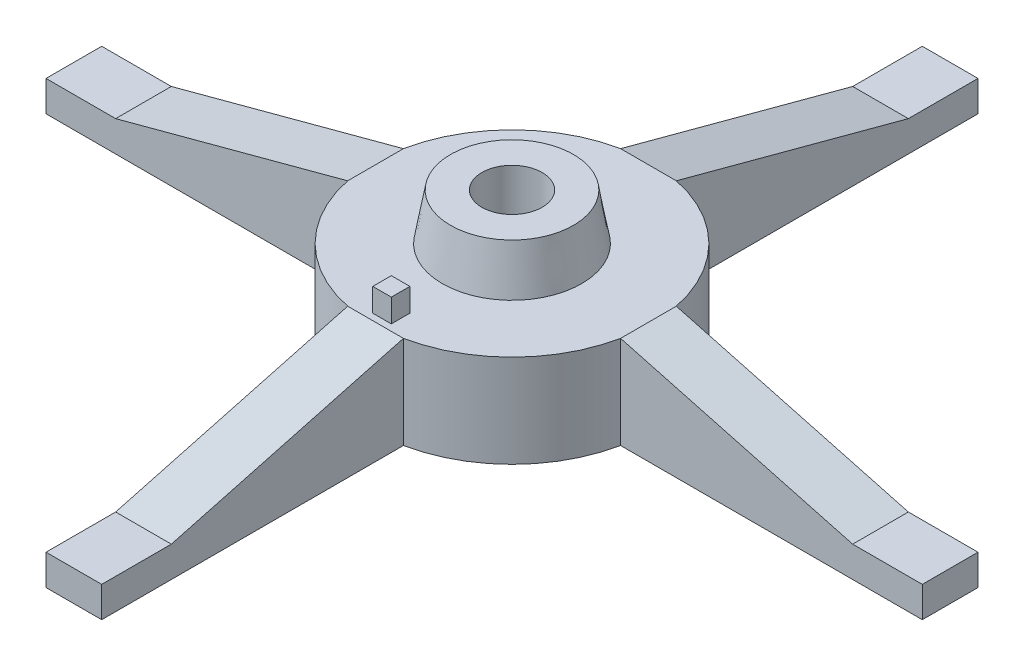
ISO-10303-21;
HEADER;
FILE_DESCRIPTION(('STEP AP214'),'2;1');
FILE_NAME('part.step','',(''),(''),'','','');
FILE_SCHEMA(('AUTOMOTIVE_DESIGN { 1 0 10303 214 1 1 1 1 }'));
ENDSEC;
DATA;
#1=APPLICATION_CONTEXT('core data for automotive mechanical design processes');
#2=APPLICATION_PROTOCOL_DEFINITION('international standard','automotive_design',2000,#1);
#3=PRODUCT_CONTEXT('',#1,'mechanical');
#4=PRODUCT('Part','Part','',(#3));
#5=PRODUCT_RELATED_PRODUCT_CATEGORY('part','',(#4));
#6=PRODUCT_DEFINITION_FORMATION('','',#4);
#7=PRODUCT_DEFINITION_CONTEXT('part definition',#1,'design');
#8=PRODUCT_DEFINITION('design','',#6,#7);
#9=PRODUCT_DEFINITION_SHAPE('','',#8);
#10=(LENGTH_UNIT() NAMED_UNIT(*) SI_UNIT(.MILLI.,.METRE.));
#11=(NAMED_UNIT(*) PLANE_ANGLE_UNIT() SI_UNIT($,.RADIAN.));
#12=(NAMED_UNIT(*) SI_UNIT($,.STERADIAN.) SOLID_ANGLE_UNIT());
#13=UNCERTAINTY_MEASURE_WITH_UNIT(LENGTH_MEASURE(1.E-05),#10,'distance_accuracy_value','');
#14=(GEOMETRIC_REPRESENTATION_CONTEXT(3) GLOBAL_UNCERTAINTY_ASSIGNED_CONTEXT((#13)) GLOBAL_UNIT_ASSIGNED_CONTEXT((#10,
#11,#12)) REPRESENTATION_CONTEXT('',''));
#15=CARTESIAN_POINT('',(0.,0.,0.));
#16=DIRECTION('',(0.,0.,1.));
#17=DIRECTION('',(1.,0.,0.));
#18=AXIS2_PLACEMENT_3D('',#15,#16,#17);
#19=CARTESIAN_POINT('',(0.,20.,0.));
#20=DIRECTION('',(0.,1.,0.));
#21=DIRECTION('',(0.,0.,1.));
#22=AXIS2_PLACEMENT_3D('',#19,#20,#21);
#23=PLANE('',#22);
#24=CARTESIAN_POINT('',(0.,20.,0.));
#25=DIRECTION('',(0.,1.,0.));
#26=DIRECTION('',(0.,0.,1.));
#27=AXIS2_PLACEMENT_3D('',#24,#25,#26);
#28=CIRCLE('',#27,15.);
#29=CARTESIAN_POINT('',(0.,20.,15.));
#30=VERTEX_POINT('',#29);
#31=EDGE_CURVE('E221',#30,#30,#28,.T.);
#32=ORIENTED_EDGE('',*,*,#31,.F.);
#33=EDGE_LOOP('',(#32));
#34=FACE_BOUND('',#33,.T.);
#35=DIRECTION('',(0.,0.,1.));
#36=VECTOR('',#35,1.);
#37=CARTESIAN_POINT('',(29.3938769133991,20.,-94.3938769133988));
#38=LINE('',#37,#36);
#39=CARTESIAN_POINT('',(29.3938769133982,20.,-5.99999999999935));
#40=VERTEX_POINT('',#39);
#41=CARTESIAN_POINT('',(29.3938769133981,20.,6.00000000000031));
#42=VERTEX_POINT('',#41);
#43=EDGE_CURVE('E234',#40,#42,#38,.T.);
#44=ORIENTED_EDGE('',*,*,#43,.F.);
#45=CARTESIAN_POINT('',(0.,20.,0.));
#46=DIRECTION('',(0.,1.,0.));
#47=DIRECTION('',(0.,0.,1.));
#48=AXIS2_PLACEMENT_3D('',#45,#46,#47);
#49=CIRCLE('',#48,30.);
#50=CARTESIAN_POINT('',(6.,20.,-29.3938769133981));
#51=VERTEX_POINT('',#50);
#52=EDGE_CURVE('E358',#40,#51,#49,.T.);
#53=ORIENTED_EDGE('',*,*,#52,.T.);
#54=DIRECTION('',(1.,0.,0.));
#55=VECTOR('',#54,1.);
#56=CARTESIAN_POINT('',(-94.3938769133982,20.,-29.3938769133981));
#57=LINE('',#56,#55);
#58=CARTESIAN_POINT('',(-6.00000000000001,20.,-29.3938769133981));
#59=VERTEX_POINT('',#58);
#60=EDGE_CURVE('E246',#59,#51,#57,.T.);
#61=ORIENTED_EDGE('',*,*,#60,.F.);
#62=CARTESIAN_POINT('',(-29.3938769133981,20.,-6.00000000000011));
#63=VERTEX_POINT('',#62);
#64=EDGE_CURVE('E771',#59,#63,#49,.T.);
#65=ORIENTED_EDGE('',*,*,#64,.T.);
#66=DIRECTION('',(0.,0.,-1.));
#67=VECTOR('',#66,1.);
#68=CARTESIAN_POINT('',(-29.3938769133985,20.,94.3938769133984));
#69=LINE('',#68,#67);
#70=CARTESIAN_POINT('',(-29.3938769133982,20.,5.99999999999978));
#71=VERTEX_POINT('',#70);
#72=EDGE_CURVE('E258',#71,#63,#69,.T.);
#73=ORIENTED_EDGE('',*,*,#72,.F.);
#74=CARTESIAN_POINT('',(-6.,20.,29.3938769133981));
#75=VERTEX_POINT('',#74);
#76=EDGE_CURVE('E359',#71,#75,#49,.T.);
#77=ORIENTED_EDGE('',*,*,#76,.T.);
#78=DIRECTION('',(-1.,0.,0.));
#79=VECTOR('',#78,1.);
#80=CARTESIAN_POINT('',(30.,20.,29.3938769133981));
#81=LINE('',#80,#79);
#82=CARTESIAN_POINT('',(6.00000000000001,20.,29.3938769133981));
#83=VERTEX_POINT('',#82);
#84=EDGE_CURVE('E327',#83,#75,#81,.T.);
#85=ORIENTED_EDGE('',*,*,#84,.F.);
#86=EDGE_CURVE('E354',#83,#42,#49,.T.);
#87=ORIENTED_EDGE('',*,*,#86,.T.);
#88=EDGE_LOOP('',(#44,#53,#61,#65,#73,#77,#85,#87));
#89=FACE_BOUND('',#88,.T.);
#90=DIRECTION('',(0.,0.,1.));
#91=VECTOR('',#90,1.);
#92=CARTESIAN_POINT('',(2.,20.,0.));
#93=LINE('',#92,#91);
#94=CARTESIAN_POINT('',(2.,20.,24.));
#95=VERTEX_POINT('',#94);
#96=CARTESIAN_POINT('',(2.,20.,28.));
#97=VERTEX_POINT('',#96);
#98=EDGE_CURVE('E40',#95,#97,#93,.T.);
#99=ORIENTED_EDGE('',*,*,#98,.T.);
#100=DIRECTION('',(-1.,0.,0.));
#101=VECTOR('',#100,1.);
#102=CARTESIAN_POINT('',(0.,20.,28.));
#103=LINE('',#102,#101);
#104=CARTESIAN_POINT('',(-2.,20.,28.));
#105=VERTEX_POINT('',#104);
#106=EDGE_CURVE('E11',#97,#105,#103,.T.);
#107=ORIENTED_EDGE('',*,*,#106,.T.);
#108=DIRECTION('',(0.,0.,1.));
#109=VECTOR('',#108,1.);
#110=CARTESIAN_POINT('',(-2.,20.,0.));
#111=LINE('',#110,#109);
#112=CARTESIAN_POINT('',(-2.,20.,24.));
#113=VERTEX_POINT('',#112);
#114=EDGE_CURVE('E386',#113,#105,#111,.T.);
#115=ORIENTED_EDGE('',*,*,#114,.F.);
#116=DIRECTION('',(-1.,0.,0.));
#117=VECTOR('',#116,1.);
#118=CARTESIAN_POINT('',(0.,20.,24.));
#119=LINE('',#118,#117);
#120=EDGE_CURVE('E50',#95,#113,#119,.T.);
#121=ORIENTED_EDGE('',*,*,#120,.F.);
#122=EDGE_LOOP('',(#99,#107,#115,#121));
#123=FACE_BOUND('',#122,.T.);
#124=ADVANCED_FACE('F32',(#34,#89,#123),#23,.T.);
#125=CARTESIAN_POINT('',(0.,0.,0.));
#126=DIRECTION('',(0.,1.,0.));
#127=DIRECTION('',(0.,0.,1.));
#128=AXIS2_PLACEMENT_3D('',#125,#126,#127);
#129=PLANE('',#128);
#130=CARTESIAN_POINT('',(0.,0.,0.));
#131=DIRECTION('',(0.,1.,0.));
#132=DIRECTION('',(0.,0.,1.));
#133=AXIS2_PLACEMENT_3D('',#130,#131,#132);
#134=CIRCLE('',#133,6.5);
#135=CARTESIAN_POINT('',(0.,0.,6.5));
#136=VERTEX_POINT('',#135);
#137=EDGE_CURVE('E211',#136,#136,#134,.T.);
#138=ORIENTED_EDGE('',*,*,#137,.T.);
#139=EDGE_LOOP('',(#138));
#140=FACE_BOUND('',#139,.T.);
#141=CARTESIAN_POINT('',(0.,0.,0.));
#142=DIRECTION('',(0.,1.,0.));
#143=DIRECTION('',(0.,0.,1.));
#144=AXIS2_PLACEMENT_3D('',#141,#142,#143);
#145=CIRCLE('',#144,30.);
#146=CARTESIAN_POINT('',(6.,0.,29.3938769133981));
#147=VERTEX_POINT('',#146);
#148=CARTESIAN_POINT('',(29.3938769133981,0.,6.00000000000031));
#149=VERTEX_POINT('',#148);
#150=EDGE_CURVE('E360',#147,#149,#145,.T.);
#151=ORIENTED_EDGE('',*,*,#150,.F.);
#152=DIRECTION('',(0.,0.,-1.));
#153=VECTOR('',#152,1.);
#154=CARTESIAN_POINT('',(6.,0.,0.));
#155=LINE('',#154,#153);
#156=CARTESIAN_POINT('',(6.,0.,94.3938769133981));
#157=VERTEX_POINT('',#156);
#158=EDGE_CURVE('E335',#157,#147,#155,.T.);
#159=ORIENTED_EDGE('',*,*,#158,.F.);
#160=DIRECTION('',(1.,0.,0.));
#161=VECTOR('',#160,1.);
#162=CARTESIAN_POINT('',(0.,0.,94.3938769133981));
#163=LINE('',#162,#161);
#164=CARTESIAN_POINT('',(-6.,0.,94.3938769133981));
#165=VERTEX_POINT('',#164);
#166=EDGE_CURVE('E340',#165,#157,#163,.T.);
#167=ORIENTED_EDGE('',*,*,#166,.F.);
#168=DIRECTION('',(0.,0.,1.));
#169=VECTOR('',#168,1.);
#170=CARTESIAN_POINT('',(-6.00000000000001,0.,0.));
#171=LINE('',#170,#169);
#172=CARTESIAN_POINT('',(-6.,0.,29.3938769133981));
#173=VERTEX_POINT('',#172);
#174=EDGE_CURVE('E344',#173,#165,#171,.T.);
#175=ORIENTED_EDGE('',*,*,#174,.F.);
#176=CARTESIAN_POINT('',(-29.3938769133982,0.,5.9999999999999));
#177=VERTEX_POINT('',#176);
#178=EDGE_CURVE('E338',#177,#173,#145,.T.);
#179=ORIENTED_EDGE('',*,*,#178,.F.);
#180=DIRECTION('',(1.,0.,0.));
#181=VECTOR('',#180,1.);
#182=CARTESIAN_POINT('',(0.,0.,6.));
#183=LINE('',#182,#181);
#184=CARTESIAN_POINT('',(-94.3938769133982,0.,5.99999999999967));
#185=VERTEX_POINT('',#184);
#186=EDGE_CURVE('E303',#185,#177,#183,.T.);
#187=ORIENTED_EDGE('',*,*,#186,.F.);
#188=DIRECTION('',(0.,0.,1.));
#189=VECTOR('',#188,1.);
#190=CARTESIAN_POINT('',(-94.3938769133981,0.,-3.29574459744185E-13));
#191=LINE('',#190,#189);
#192=CARTESIAN_POINT('',(-94.3938769133981,0.,-6.00000000000033));
#193=VERTEX_POINT('',#192);
#194=EDGE_CURVE('E308',#193,#185,#191,.T.);
#195=ORIENTED_EDGE('',*,*,#194,.F.);
#196=DIRECTION('',(-1.,0.,0.));
#197=VECTOR('',#196,1.);
#198=CARTESIAN_POINT('',(0.,0.,-6.00000000000001));
#199=LINE('',#198,#197);
#200=CARTESIAN_POINT('',(-29.3938769133981,0.,-6.00000000000011));
#201=VERTEX_POINT('',#200);
#202=EDGE_CURVE('E312',#201,#193,#199,.T.);
#203=ORIENTED_EDGE('',*,*,#202,.F.);
#204=CARTESIAN_POINT('',(-6.,0.,-29.3938769133981));
#205=VERTEX_POINT('',#204);
#206=EDGE_CURVE('E755',#205,#201,#145,.T.);
#207=ORIENTED_EDGE('',*,*,#206,.F.);
#208=DIRECTION('',(0.,0.,1.));
#209=VECTOR('',#208,1.);
#210=CARTESIAN_POINT('',(-6.,0.,0.));
#211=LINE('',#210,#209);
#212=CARTESIAN_POINT('',(-6.,0.,-94.3938769133981));
#213=VERTEX_POINT('',#212);
#214=EDGE_CURVE('E284',#213,#205,#211,.T.);
#215=ORIENTED_EDGE('',*,*,#214,.F.);
#216=DIRECTION('',(-1.,0.,0.));
#217=VECTOR('',#216,1.);
#218=CARTESIAN_POINT('',(0.,0.,-94.3938769133981));
#219=LINE('',#218,#217);
#220=CARTESIAN_POINT('',(6.,0.,-94.3938769133981));
#221=VERTEX_POINT('',#220);
#222=EDGE_CURVE('E289',#221,#213,#219,.T.);
#223=ORIENTED_EDGE('',*,*,#222,.F.);
#224=DIRECTION('',(0.,0.,-1.));
#225=VECTOR('',#224,1.);
#226=CARTESIAN_POINT('',(6.00000000000001,0.,0.));
#227=LINE('',#226,#225);
#228=CARTESIAN_POINT('',(6.,0.,-29.3938769133981));
#229=VERTEX_POINT('',#228);
#230=EDGE_CURVE('E293',#229,#221,#227,.T.);
#231=ORIENTED_EDGE('',*,*,#230,.F.);
#232=CARTESIAN_POINT('',(29.3938769133982,0.,-5.9999999999997));
#233=VERTEX_POINT('',#232);
#234=EDGE_CURVE('E362',#233,#229,#145,.T.);
#235=ORIENTED_EDGE('',*,*,#234,.F.);
#236=DIRECTION('',(-1.,0.,0.));
#237=VECTOR('',#236,1.);
#238=CARTESIAN_POINT('',(0.,0.,-6.));
#239=LINE('',#238,#237);
#240=CARTESIAN_POINT('',(94.3938769133982,0.,-5.99999999999902));
#241=VERTEX_POINT('',#240);
#242=EDGE_CURVE('E265',#241,#233,#239,.T.);
#243=ORIENTED_EDGE('',*,*,#242,.F.);
#244=DIRECTION('',(0.,0.,-1.));
#245=VECTOR('',#244,1.);
#246=CARTESIAN_POINT('',(94.3938769133981,0.,9.88723379232556E-13));
#247=LINE('',#246,#245);
#248=CARTESIAN_POINT('',(94.3938769133981,0.,6.00000000000098));
#249=VERTEX_POINT('',#248);
#250=EDGE_CURVE('E270',#249,#241,#247,.T.);
#251=ORIENTED_EDGE('',*,*,#250,.F.);
#252=DIRECTION('',(1.,0.,0.));
#253=VECTOR('',#252,1.);
#254=CARTESIAN_POINT('',(0.,0.,6.00000000000001));
#255=LINE('',#254,#253);
#256=EDGE_CURVE('E274',#149,#249,#255,.T.);
#257=ORIENTED_EDGE('',*,*,#256,.F.);
#258=EDGE_LOOP('',(#151,#159,#167,#175,#179,#187,#195,#203,#207,#215,#223,#231,#235,#243,#251,#257));
#259=FACE_BOUND('',#258,.T.);
#260=ADVANCED_FACE('F399',(#140,#259),#129,.F.);
#261=CARTESIAN_POINT('',(0.,30.,0.));
#262=DIRECTION('',(0.,1.,0.));
#263=DIRECTION('',(0.,0.,1.));
#264=AXIS2_PLACEMENT_3D('',#261,#262,#263);
#265=PLANE('',#264);
#266=CARTESIAN_POINT('',(0.,30.,0.));
#267=DIRECTION('',(0.,1.,0.));
#268=DIRECTION('',(0.,0.,1.));
#269=AXIS2_PLACEMENT_3D('',#266,#267,#268);
#270=CIRCLE('',#269,13.2367301929153);
#271=CARTESIAN_POINT('',(0.,30.,13.2367301929153));
#272=VERTEX_POINT('',#271);
#273=EDGE_CURVE('E225',#272,#272,#270,.T.);
#274=ORIENTED_EDGE('',*,*,#273,.T.);
#275=EDGE_LOOP('',(#274));
#276=FACE_BOUND('',#275,.T.);
#277=CARTESIAN_POINT('',(0.,30.,0.));
#278=DIRECTION('',(0.,1.,0.));
#279=DIRECTION('',(0.,0.,1.));
#280=AXIS2_PLACEMENT_3D('',#277,#278,#279);
#281=CIRCLE('',#280,6.5);
#282=CARTESIAN_POINT('',(0.,30.,6.5));
#283=VERTEX_POINT('',#282);
#284=EDGE_CURVE('E214',#283,#283,#281,.T.);
#285=ORIENTED_EDGE('',*,*,#284,.F.);
#286=EDGE_LOOP('',(#285));
#287=FACE_BOUND('',#286,.T.);
#288=ADVANCED_FACE('F405',(#276,#287),#265,.T.);
#289=CARTESIAN_POINT('',(0.,20.,0.));
#290=DIRECTION('',(0.,-1.,0.));
#291=DIRECTION('',(0.,0.,-1.));
#292=AXIS2_PLACEMENT_3D('',#289,#290,#291);
#293=CYLINDRICAL_SURFACE('',#292,30.);
#294=DIRECTION('',(0.,-1.,0.));
#295=VECTOR('',#294,1.);
#296=CARTESIAN_POINT('',(29.3938769133981,86.0984114786432,6.00000000000031));
#297=LINE('',#296,#295);
#298=EDGE_CURVE('E277',#42,#149,#297,.T.);
#299=ORIENTED_EDGE('',*,*,#298,.F.);
#300=ORIENTED_EDGE('',*,*,#86,.F.);
#301=DIRECTION('',(0.,-1.,0.));
#302=VECTOR('',#301,1.);
#303=CARTESIAN_POINT('',(6.,86.098411478643,29.3938769133981));
#304=LINE('',#303,#302);
#305=EDGE_CURVE('E330',#83,#147,#304,.T.);
#306=ORIENTED_EDGE('',*,*,#305,.T.);
#307=ORIENTED_EDGE('',*,*,#150,.T.);
#308=EDGE_LOOP('',(#299,#300,#306,#307));
#309=FACE_BOUND('',#308,.T.);
#310=ADVANCED_FACE('F34',(#309),#293,.T.);
#311=DIRECTION('',(0.,-1.,0.));
#312=VECTOR('',#311,1.);
#313=CARTESIAN_POINT('',(29.3938769133982,86.0984114786432,-5.9999999999997));
#314=LINE('',#313,#312);
#315=EDGE_CURVE('E260',#40,#233,#314,.T.);
#316=ORIENTED_EDGE('',*,*,#315,.T.);
#317=ORIENTED_EDGE('',*,*,#234,.T.);
#318=DIRECTION('',(0.,-1.,0.));
#319=VECTOR('',#318,1.);
#320=CARTESIAN_POINT('',(6.,86.098411478643,-29.3938769133981));
#321=LINE('',#320,#319);
#322=EDGE_CURVE('E296',#51,#229,#321,.T.);
#323=ORIENTED_EDGE('',*,*,#322,.F.);
#324=ORIENTED_EDGE('',*,*,#52,.F.);
#325=EDGE_LOOP('',(#316,#317,#323,#324));
#326=FACE_BOUND('',#325,.T.);
#327=ADVANCED_FACE('F633',(#326),#293,.T.);
#328=DIRECTION('',(0.,-1.,0.));
#329=VECTOR('',#328,1.);
#330=CARTESIAN_POINT('',(-6.,86.098411478643,-29.3938769133981));
#331=LINE('',#330,#329);
#332=EDGE_CURVE('E268',#59,#205,#331,.T.);
#333=ORIENTED_EDGE('',*,*,#332,.T.);
#334=ORIENTED_EDGE('',*,*,#206,.T.);
#335=DIRECTION('',(0.,-1.,0.));
#336=VECTOR('',#335,1.);
#337=CARTESIAN_POINT('',(-29.3938769133981,86.0984114786431,-6.00000000000011));
#338=LINE('',#337,#336);
#339=EDGE_CURVE('E315',#63,#201,#338,.T.);
#340=ORIENTED_EDGE('',*,*,#339,.F.);
#341=ORIENTED_EDGE('',*,*,#64,.F.);
#342=EDGE_LOOP('',(#333,#334,#340,#341));
#343=FACE_BOUND('',#342,.T.);
#344=ADVANCED_FACE('F626',(#343),#293,.T.);
#345=DIRECTION('',(0.,-1.,0.));
#346=VECTOR('',#345,1.);
#347=CARTESIAN_POINT('',(-29.3938769133982,86.0984114786431,5.9999999999999));
#348=LINE('',#347,#346);
#349=EDGE_CURVE('E287',#71,#177,#348,.T.);
#350=ORIENTED_EDGE('',*,*,#349,.T.);
#351=ORIENTED_EDGE('',*,*,#178,.T.);
#352=DIRECTION('',(0.,-1.,0.));
#353=VECTOR('',#352,1.);
#354=CARTESIAN_POINT('',(-6.,86.098411478643,29.3938769133981));
#355=LINE('',#354,#353);
#356=EDGE_CURVE('E347',#75,#173,#355,.T.);
#357=ORIENTED_EDGE('',*,*,#356,.F.);
#358=ORIENTED_EDGE('',*,*,#76,.F.);
#359=EDGE_LOOP('',(#350,#351,#357,#358));
#360=FACE_BOUND('',#359,.T.);
#361=ADVANCED_FACE('F414',(#360),#293,.T.);
#362=CARTESIAN_POINT('',(-6.00000000000001,86.098411478643,0.));
#363=DIRECTION('',(1.,0.,0.));
#364=DIRECTION('',(0.,0.,-1.));
#365=AXIS2_PLACEMENT_3D('',#362,#363,#364);
#366=PLANE('',#365);
#367=DIRECTION('',(0.,0.,1.));
#368=VECTOR('',#367,1.);
#369=CARTESIAN_POINT('',(-6.,6.60254037844422,94.3938769133981));
#370=LINE('',#369,#368);
#371=CARTESIAN_POINT('',(-6.,6.60254037844422,79.3938769133981));
#372=VERTEX_POINT('',#371);
#373=CARTESIAN_POINT('',(-6.,6.60254037844422,94.3938769133981));
#374=VERTEX_POINT('',#373);
#375=EDGE_CURVE('E324',#372,#374,#370,.T.);
#376=ORIENTED_EDGE('',*,*,#375,.F.);
#377=DIRECTION('',(0.,-0.258819045102514,0.96592582628907));
#378=VECTOR('',#377,1.);
#379=CARTESIAN_POINT('',(-6.,6.60254037844422,79.3938769133981));
#380=LINE('',#379,#378);
#381=EDGE_CURVE('E306',#75,#372,#380,.T.);
#382=ORIENTED_EDGE('',*,*,#381,.F.);
#383=ORIENTED_EDGE('',*,*,#356,.T.);
#384=ORIENTED_EDGE('',*,*,#174,.T.);
#385=DIRECTION('',(0.,-1.,0.));
#386=VECTOR('',#385,1.);
#387=CARTESIAN_POINT('',(-6.,86.098411478643,94.3938769133981));
#388=LINE('',#387,#386);
#389=EDGE_CURVE('E343',#374,#165,#388,.T.);
#390=ORIENTED_EDGE('',*,*,#389,.F.);
#391=EDGE_LOOP('',(#376,#382,#383,#384,#390));
#392=FACE_BOUND('',#391,.T.);
#393=ADVANCED_FACE('F410',(#392),#366,.F.);
#394=CARTESIAN_POINT('',(0.,86.098411478643,94.3938769133981));
#395=DIRECTION('',(0.,0.,-1.));
#396=DIRECTION('',(-1.,0.,0.));
#397=AXIS2_PLACEMENT_3D('',#394,#395,#396);
#398=PLANE('',#397);
#399=DIRECTION('',(0.,-1.,0.));
#400=VECTOR('',#399,1.);
#401=CARTESIAN_POINT('',(6.,86.098411478643,94.3938769133981));
#402=LINE('',#401,#400);
#403=CARTESIAN_POINT('',(6.,6.60254037844425,94.3938769133981));
#404=VERTEX_POINT('',#403);
#405=EDGE_CURVE('E339',#404,#157,#402,.T.);
#406=ORIENTED_EDGE('',*,*,#405,.F.);
#407=DIRECTION('',(-1.,0.,0.));
#408=VECTOR('',#407,1.);
#409=CARTESIAN_POINT('',(30.,6.60254037844422,94.3938769133981));
#410=LINE('',#409,#408);
#411=EDGE_CURVE('E331',#404,#374,#410,.T.);
#412=ORIENTED_EDGE('',*,*,#411,.T.);
#413=ORIENTED_EDGE('',*,*,#389,.T.);
#414=ORIENTED_EDGE('',*,*,#166,.T.);
#415=EDGE_LOOP('',(#406,#412,#413,#414));
#416=FACE_BOUND('',#415,.T.);
#417=ADVANCED_FACE('F413',(#416),#398,.F.);
#418=CARTESIAN_POINT('',(6.,86.098411478643,0.));
#419=DIRECTION('',(-1.,0.,0.));
#420=DIRECTION('',(0.,0.,1.));
#421=AXIS2_PLACEMENT_3D('',#418,#419,#420);
#422=PLANE('',#421);
#423=ORIENTED_EDGE('',*,*,#305,.F.);
#424=DIRECTION('',(0.,-0.258819045102514,0.96592582628907));
#425=VECTOR('',#424,1.);
#426=CARTESIAN_POINT('',(6.,31.7762232225198,-14.5555864743192));
#427=LINE('',#426,#425);
#428=CARTESIAN_POINT('',(6.00000000000001,6.60254037844422,79.3938769133981));
#429=VERTEX_POINT('',#428);
#430=EDGE_CURVE('E365',#83,#429,#427,.T.);
#431=ORIENTED_EDGE('',*,*,#430,.T.);
#432=DIRECTION('',(0.,0.,1.));
#433=VECTOR('',#432,1.);
#434=CARTESIAN_POINT('',(6.,6.60254037844421,0.));
#435=LINE('',#434,#433);
#436=EDGE_CURVE('E357',#429,#404,#435,.T.);
#437=ORIENTED_EDGE('',*,*,#436,.T.);
#438=ORIENTED_EDGE('',*,*,#405,.T.);
#439=ORIENTED_EDGE('',*,*,#158,.T.);
#440=EDGE_LOOP('',(#423,#431,#437,#438,#439));
#441=FACE_BOUND('',#440,.T.);
#442=ADVANCED_FACE('F418',(#441),#422,.F.);
#443=CARTESIAN_POINT('',(30.,6.60254037844422,79.3938769133981));
#444=DIRECTION('',(0.,-0.96592582628907,-0.258819045102514));
#445=DIRECTION('',(0.,0.258819045102514,-0.96592582628907));
#446=AXIS2_PLACEMENT_3D('',#443,#444,#445);
#447=PLANE('',#446);
#448=ORIENTED_EDGE('',*,*,#84,.T.);
#449=ORIENTED_EDGE('',*,*,#381,.T.);
#450=DIRECTION('',(-1.,0.,0.));
#451=VECTOR('',#450,1.);
#452=CARTESIAN_POINT('',(30.,6.60254037844422,79.3938769133981));
#453=LINE('',#452,#451);
#454=EDGE_CURVE('E326',#429,#372,#453,.T.);
#455=ORIENTED_EDGE('',*,*,#454,.F.);
#456=ORIENTED_EDGE('',*,*,#430,.F.);
#457=EDGE_LOOP('',(#448,#449,#455,#456));
#458=FACE_BOUND('',#457,.T.);
#459=ADVANCED_FACE('F422',(#458),#447,.F.);
#460=CARTESIAN_POINT('',(30.,6.60254037844422,94.3938769133981));
#461=DIRECTION('',(0.,-1.,0.));
#462=DIRECTION('',(0.,0.,-1.));
#463=AXIS2_PLACEMENT_3D('',#460,#461,#462);
#464=PLANE('',#463);
#465=ORIENTED_EDGE('',*,*,#454,.T.);
#466=ORIENTED_EDGE('',*,*,#375,.T.);
#467=ORIENTED_EDGE('',*,*,#411,.F.);
#468=ORIENTED_EDGE('',*,*,#436,.F.);
#469=EDGE_LOOP('',(#465,#466,#467,#468));
#470=FACE_BOUND('',#469,.T.);
#471=ADVANCED_FACE('F426',(#470),#464,.F.);
#472=CARTESIAN_POINT('',(0.,86.0984114786431,-6.00000000000001));
#473=DIRECTION('',(0.,0.,1.));
#474=DIRECTION('',(1.,0.,0.));
#475=AXIS2_PLACEMENT_3D('',#472,#473,#474);
#476=PLANE('',#475);
#477=DIRECTION('',(-1.,0.,0.));
#478=VECTOR('',#477,1.);
#479=CARTESIAN_POINT('',(-94.3938769133981,6.60254037844422,-6.00000000000033));
#480=LINE('',#479,#478);
#481=CARTESIAN_POINT('',(-79.3938769133981,6.60254037844422,-6.00000000000028));
#482=VERTEX_POINT('',#481);
#483=CARTESIAN_POINT('',(-94.3938769133981,6.60254037844422,-6.00000000000033));
#484=VERTEX_POINT('',#483);
#485=EDGE_CURVE('E255',#482,#484,#480,.T.);
#486=ORIENTED_EDGE('',*,*,#485,.F.);
#487=DIRECTION('',(-0.96592582628907,-0.258819045102514,0.));
#488=VECTOR('',#487,1.);
#489=CARTESIAN_POINT('',(-79.3938769133981,6.60254037844422,-6.00000000000028));
#490=LINE('',#489,#488);
#491=EDGE_CURVE('E248',#63,#482,#490,.T.);
#492=ORIENTED_EDGE('',*,*,#491,.F.);
#493=ORIENTED_EDGE('',*,*,#339,.T.);
#494=ORIENTED_EDGE('',*,*,#202,.T.);
#495=DIRECTION('',(0.,-1.,0.));
#496=VECTOR('',#495,1.);
#497=CARTESIAN_POINT('',(-94.3938769133981,86.0984114786431,-6.00000000000033));
#498=LINE('',#497,#496);
#499=EDGE_CURVE('E311',#484,#193,#498,.T.);
#500=ORIENTED_EDGE('',*,*,#499,.F.);
#501=EDGE_LOOP('',(#486,#492,#493,#494,#500));
#502=FACE_BOUND('',#501,.T.);
#503=ADVANCED_FACE('F430',(#502),#476,.F.);
#504=CARTESIAN_POINT('',(-94.3938769133981,86.0984114786431,-3.29574459744185E-13));
#505=DIRECTION('',(1.,0.,0.));
#506=DIRECTION('',(0.,0.,-1.));
#507=AXIS2_PLACEMENT_3D('',#504,#505,#506);
#508=PLANE('',#507);
#509=DIRECTION('',(0.,-1.,0.));
#510=VECTOR('',#509,1.);
#511=CARTESIAN_POINT('',(-94.3938769133982,86.0984114786431,5.99999999999967));
#512=LINE('',#511,#510);
#513=CARTESIAN_POINT('',(-94.3938769133982,6.60254037844422,5.99999999999967));
#514=VERTEX_POINT('',#513);
#515=EDGE_CURVE('E307',#514,#185,#512,.T.);
#516=ORIENTED_EDGE('',*,*,#515,.F.);
#517=DIRECTION('',(0.,0.,-1.));
#518=VECTOR('',#517,1.);
#519=CARTESIAN_POINT('',(-94.3938769133984,6.60254037844422,94.3938769133981));
#520=LINE('',#519,#518);
#521=EDGE_CURVE('E261',#514,#484,#520,.T.);
#522=ORIENTED_EDGE('',*,*,#521,.T.);
#523=ORIENTED_EDGE('',*,*,#499,.T.);
#524=ORIENTED_EDGE('',*,*,#194,.T.);
#525=EDGE_LOOP('',(#516,#522,#523,#524));
#526=FACE_BOUND('',#525,.T.);
#527=ADVANCED_FACE('F434',(#526),#508,.F.);
#528=CARTESIAN_POINT('',(0.,86.0984114786431,6.));
#529=DIRECTION('',(0.,0.,-1.));
#530=DIRECTION('',(-1.,0.,0.));
#531=AXIS2_PLACEMENT_3D('',#528,#529,#530);
#532=PLANE('',#531);
#533=ORIENTED_EDGE('',*,*,#349,.F.);
#534=DIRECTION('',(-0.96592582628907,-0.258819045102514,0.));
#535=VECTOR('',#534,1.);
#536=CARTESIAN_POINT('',(14.5555864743192,31.7762232225198,6.00000000000005));
#537=LINE('',#536,#535);
#538=CARTESIAN_POINT('',(-79.3938769133981,6.60254037844422,5.9999999999997));
#539=VERTEX_POINT('',#538);
#540=EDGE_CURVE('E371',#71,#539,#537,.T.);
#541=ORIENTED_EDGE('',*,*,#540,.T.);
#542=DIRECTION('',(-1.,0.,0.));
#543=VECTOR('',#542,1.);
#544=CARTESIAN_POINT('',(0.,6.60254037844421,6.));
#545=LINE('',#544,#543);
#546=EDGE_CURVE('E368',#539,#514,#545,.T.);
#547=ORIENTED_EDGE('',*,*,#546,.T.);
#548=ORIENTED_EDGE('',*,*,#515,.T.);
#549=ORIENTED_EDGE('',*,*,#186,.T.);
#550=EDGE_LOOP('',(#533,#541,#547,#548,#549));
#551=FACE_BOUND('',#550,.T.);
#552=ADVANCED_FACE('F438',(#551),#532,.F.);
#553=CARTESIAN_POINT('',(6.00000000000001,86.098411478643,0.));
#554=DIRECTION('',(-1.,0.,0.));
#555=DIRECTION('',(0.,0.,1.));
#556=AXIS2_PLACEMENT_3D('',#553,#554,#555);
#557=PLANE('',#556);
#558=DIRECTION('',(0.,0.,-1.));
#559=VECTOR('',#558,1.);
#560=CARTESIAN_POINT('',(6.,6.60254037844422,-94.3938769133981));
#561=LINE('',#560,#559);
#562=CARTESIAN_POINT('',(6.,6.60254037844422,-79.3938769133981));
#563=VERTEX_POINT('',#562);
#564=CARTESIAN_POINT('',(6.,6.60254037844422,-94.3938769133981));
#565=VERTEX_POINT('',#564);
#566=EDGE_CURVE('E243',#563,#565,#561,.T.);
#567=ORIENTED_EDGE('',*,*,#566,.F.);
#568=DIRECTION('',(0.,-0.258819045102514,-0.96592582628907));
#569=VECTOR('',#568,1.);
#570=CARTESIAN_POINT('',(6.,6.60254037844422,-79.3938769133981));
#571=LINE('',#570,#569);
#572=EDGE_CURVE('E236',#51,#563,#571,.T.);
#573=ORIENTED_EDGE('',*,*,#572,.F.);
#574=ORIENTED_EDGE('',*,*,#322,.T.);
#575=ORIENTED_EDGE('',*,*,#230,.T.);
#576=DIRECTION('',(0.,-1.,0.));
#577=VECTOR('',#576,1.);
#578=CARTESIAN_POINT('',(6.,86.098411478643,-94.3938769133981));
#579=LINE('',#578,#577);
#580=EDGE_CURVE('E292',#565,#221,#579,.T.);
#581=ORIENTED_EDGE('',*,*,#580,.F.);
#582=EDGE_LOOP('',(#567,#573,#574,#575,#581));
#583=FACE_BOUND('',#582,.T.);
#584=ADVANCED_FACE('F442',(#583),#557,.F.);
#585=CARTESIAN_POINT('',(0.,86.098411478643,-94.3938769133981));
#586=DIRECTION('',(0.,0.,1.));
#587=DIRECTION('',(1.,0.,0.));
#588=AXIS2_PLACEMENT_3D('',#585,#586,#587);
#589=PLANE('',#588);
#590=DIRECTION('',(0.,-1.,0.));
#591=VECTOR('',#590,1.);
#592=CARTESIAN_POINT('',(-6.,86.098411478643,-94.3938769133981));
#593=LINE('',#592,#591);
#594=CARTESIAN_POINT('',(-6.,6.60254037844425,-94.3938769133981));
#595=VERTEX_POINT('',#594);
#596=EDGE_CURVE('E288',#595,#213,#593,.T.);
#597=ORIENTED_EDGE('',*,*,#596,.F.);
#598=DIRECTION('',(1.,0.,0.));
#599=VECTOR('',#598,1.);
#600=CARTESIAN_POINT('',(-94.3938769133982,6.60254037844422,-94.3938769133981));
#601=LINE('',#600,#599);
#602=EDGE_CURVE('E249',#595,#565,#601,.T.);
#603=ORIENTED_EDGE('',*,*,#602,.T.);
#604=ORIENTED_EDGE('',*,*,#580,.T.);
#605=ORIENTED_EDGE('',*,*,#222,.T.);
#606=EDGE_LOOP('',(#597,#603,#604,#605));
#607=FACE_BOUND('',#606,.T.);
#608=ADVANCED_FACE('F446',(#607),#589,.F.);
#609=CARTESIAN_POINT('',(-6.,86.098411478643,0.));
#610=DIRECTION('',(1.,0.,0.));
#611=DIRECTION('',(0.,0.,-1.));
#612=AXIS2_PLACEMENT_3D('',#609,#610,#611);
#613=PLANE('',#612);
#614=ORIENTED_EDGE('',*,*,#332,.F.);
#615=DIRECTION('',(0.,-0.258819045102514,-0.96592582628907));
#616=VECTOR('',#615,1.);
#617=CARTESIAN_POINT('',(-6.,31.7762232225198,14.5555864743192));
#618=LINE('',#617,#616);
#619=CARTESIAN_POINT('',(-6.00000000000001,6.60254037844422,-79.3938769133981));
#620=VERTEX_POINT('',#619);
#621=EDGE_CURVE('E377',#59,#620,#618,.T.);
#622=ORIENTED_EDGE('',*,*,#621,.T.);
#623=DIRECTION('',(0.,0.,-1.));
#624=VECTOR('',#623,1.);
#625=CARTESIAN_POINT('',(-6.,6.60254037844421,0.));
#626=LINE('',#625,#624);
#627=EDGE_CURVE('E374',#620,#595,#626,.T.);
#628=ORIENTED_EDGE('',*,*,#627,.T.);
#629=ORIENTED_EDGE('',*,*,#596,.T.);
#630=ORIENTED_EDGE('',*,*,#214,.T.);
#631=EDGE_LOOP('',(#614,#622,#628,#629,#630));
#632=FACE_BOUND('',#631,.T.);
#633=ADVANCED_FACE('F450',(#632),#613,.F.);
#634=CARTESIAN_POINT('',(0.,86.0984114786432,6.00000000000001));
#635=DIRECTION('',(0.,0.,-1.));
#636=DIRECTION('',(-1.,0.,0.));
#637=AXIS2_PLACEMENT_3D('',#634,#635,#636);
#638=PLANE('',#637);
#639=DIRECTION('',(1.,0.,0.));
#640=VECTOR('',#639,1.);
#641=CARTESIAN_POINT('',(94.3938769133981,6.60254037844422,6.00000000000098));
#642=LINE('',#641,#640);
#643=CARTESIAN_POINT('',(79.3938769133981,6.60254037844422,6.00000000000083));
#644=VERTEX_POINT('',#643);
#645=CARTESIAN_POINT('',(94.3938769133981,6.60254037844422,6.00000000000098));
#646=VERTEX_POINT('',#645);
#647=EDGE_CURVE('E231',#644,#646,#642,.T.);
#648=ORIENTED_EDGE('',*,*,#647,.F.);
#649=DIRECTION('',(0.96592582628907,-0.258819045102514,0.));
#650=VECTOR('',#649,1.);
#651=CARTESIAN_POINT('',(79.3938769133981,6.60254037844422,6.00000000000083));
#652=LINE('',#651,#650);
#653=EDGE_CURVE('E228',#42,#644,#652,.T.);
#654=ORIENTED_EDGE('',*,*,#653,.F.);
#655=ORIENTED_EDGE('',*,*,#298,.T.);
#656=ORIENTED_EDGE('',*,*,#256,.T.);
#657=DIRECTION('',(0.,-1.,0.));
#658=VECTOR('',#657,1.);
#659=CARTESIAN_POINT('',(94.3938769133981,86.0984114786432,6.00000000000098));
#660=LINE('',#659,#658);
#661=EDGE_CURVE('E273',#646,#249,#660,.T.);
#662=ORIENTED_EDGE('',*,*,#661,.F.);
#663=EDGE_LOOP('',(#648,#654,#655,#656,#662));
#664=FACE_BOUND('',#663,.T.);
#665=ADVANCED_FACE('F454',(#664),#638,.F.);
#666=CARTESIAN_POINT('',(94.3938769133981,86.0984114786432,9.88723379232556E-13));
#667=DIRECTION('',(-1.,0.,0.));
#668=DIRECTION('',(0.,0.,1.));
#669=AXIS2_PLACEMENT_3D('',#666,#667,#668);
#670=PLANE('',#669);
#671=DIRECTION('',(0.,-1.,0.));
#672=VECTOR('',#671,1.);
#673=CARTESIAN_POINT('',(94.3938769133982,86.0984114786432,-5.99999999999902));
#674=LINE('',#673,#672);
#675=CARTESIAN_POINT('',(94.3938769133982,6.60254037844425,-5.99999999999902));
#676=VERTEX_POINT('',#675);
#677=EDGE_CURVE('E269',#676,#241,#674,.T.);
#678=ORIENTED_EDGE('',*,*,#677,.F.);
#679=DIRECTION('',(0.,0.,1.));
#680=VECTOR('',#679,1.);
#681=CARTESIAN_POINT('',(94.3938769133991,6.60254037844422,-94.3938769133981));
#682=LINE('',#681,#680);
#683=EDGE_CURVE('E237',#676,#646,#682,.T.);
#684=ORIENTED_EDGE('',*,*,#683,.T.);
#685=ORIENTED_EDGE('',*,*,#661,.T.);
#686=ORIENTED_EDGE('',*,*,#250,.T.);
#687=EDGE_LOOP('',(#678,#684,#685,#686));
#688=FACE_BOUND('',#687,.T.);
#689=ADVANCED_FACE('F458',(#688),#670,.F.);
#690=CARTESIAN_POINT('',(0.,86.0984114786432,-6.));
#691=DIRECTION('',(0.,0.,1.));
#692=DIRECTION('',(1.,0.,0.));
#693=AXIS2_PLACEMENT_3D('',#690,#691,#692);
#694=PLANE('',#693);
#695=ORIENTED_EDGE('',*,*,#315,.F.);
#696=DIRECTION('',(0.96592582628907,-0.258819045102514,0.));
#697=VECTOR('',#696,1.);
#698=CARTESIAN_POINT('',(-14.5555864743192,31.7762232225198,-6.00000000000016));
#699=LINE('',#698,#697);
#700=CARTESIAN_POINT('',(79.3938769133982,6.60254037844422,-5.99999999999909));
#701=VERTEX_POINT('',#700);
#702=EDGE_CURVE('E383',#40,#701,#699,.T.);
#703=ORIENTED_EDGE('',*,*,#702,.T.);
#704=DIRECTION('',(1.,0.,0.));
#705=VECTOR('',#704,1.);
#706=CARTESIAN_POINT('',(0.,6.60254037844421,-6.));
#707=LINE('',#706,#705);
#708=EDGE_CURVE('E380',#701,#676,#707,.T.);
#709=ORIENTED_EDGE('',*,*,#708,.T.);
#710=ORIENTED_EDGE('',*,*,#677,.T.);
#711=ORIENTED_EDGE('',*,*,#242,.T.);
#712=EDGE_LOOP('',(#695,#703,#709,#710,#711));
#713=FACE_BOUND('',#712,.T.);
#714=ADVANCED_FACE('F462',(#713),#694,.F.);
#715=CARTESIAN_POINT('',(-79.3938769133984,6.60254037844422,94.3938769133982));
#716=DIRECTION('',(0.258819045102514,-0.96592582628907,0.));
#717=DIRECTION('',(0.96592582628907,0.258819045102514,0.));
#718=AXIS2_PLACEMENT_3D('',#715,#716,#717);
#719=PLANE('',#718);
#720=ORIENTED_EDGE('',*,*,#72,.T.);
#721=ORIENTED_EDGE('',*,*,#491,.T.);
#722=DIRECTION('',(0.,0.,-1.));
#723=VECTOR('',#722,1.);
#724=CARTESIAN_POINT('',(-79.3938769133984,6.60254037844422,94.3938769133982));
#725=LINE('',#724,#723);
#726=EDGE_CURVE('E257',#539,#482,#725,.T.);
#727=ORIENTED_EDGE('',*,*,#726,.F.);
#728=ORIENTED_EDGE('',*,*,#540,.F.);
#729=EDGE_LOOP('',(#720,#721,#727,#728));
#730=FACE_BOUND('',#729,.T.);
#731=ADVANCED_FACE('F466',(#730),#719,.F.);
#732=CARTESIAN_POINT('',(-94.3938769133984,6.60254037844422,94.3938769133981));
#733=DIRECTION('',(0.,-1.,0.));
#734=DIRECTION('',(1.,0.,0.));
#735=AXIS2_PLACEMENT_3D('',#732,#733,#734);
#736=PLANE('',#735);
#737=ORIENTED_EDGE('',*,*,#726,.T.);
#738=ORIENTED_EDGE('',*,*,#485,.T.);
#739=ORIENTED_EDGE('',*,*,#521,.F.);
#740=ORIENTED_EDGE('',*,*,#546,.F.);
#741=EDGE_LOOP('',(#737,#738,#739,#740));
#742=FACE_BOUND('',#741,.T.);
#743=ADVANCED_FACE('F470',(#742),#736,.F.);
#744=CARTESIAN_POINT('',(-94.3938769133982,6.60254037844422,-79.3938769133981));
#745=DIRECTION('',(0.,-0.96592582628907,0.258819045102514));
#746=DIRECTION('',(0.,-0.258819045102514,-0.96592582628907));
#747=AXIS2_PLACEMENT_3D('',#744,#745,#746);
#748=PLANE('',#747);
#749=ORIENTED_EDGE('',*,*,#60,.T.);
#750=ORIENTED_EDGE('',*,*,#572,.T.);
#751=DIRECTION('',(1.,0.,0.));
#752=VECTOR('',#751,1.);
#753=CARTESIAN_POINT('',(-94.3938769133982,6.60254037844422,-79.3938769133981));
#754=LINE('',#753,#752);
#755=EDGE_CURVE('E245',#620,#563,#754,.T.);
#756=ORIENTED_EDGE('',*,*,#755,.F.);
#757=ORIENTED_EDGE('',*,*,#621,.F.);
#758=EDGE_LOOP('',(#749,#750,#756,#757));
#759=FACE_BOUND('',#758,.T.);
#760=ADVANCED_FACE('F474',(#759),#748,.F.);
#761=CARTESIAN_POINT('',(-94.3938769133982,6.60254037844422,-94.3938769133981));
#762=DIRECTION('',(0.,-1.,0.));
#763=DIRECTION('',(0.,0.,-1.));
#764=AXIS2_PLACEMENT_3D('',#761,#762,#763);
#765=PLANE('',#764);
#766=ORIENTED_EDGE('',*,*,#755,.T.);
#767=ORIENTED_EDGE('',*,*,#566,.T.);
#768=ORIENTED_EDGE('',*,*,#602,.F.);
#769=ORIENTED_EDGE('',*,*,#627,.F.);
#770=EDGE_LOOP('',(#766,#767,#768,#769));
#771=FACE_BOUND('',#770,.T.);
#772=ADVANCED_FACE('F478',(#771),#765,.F.);
#773=CARTESIAN_POINT('',(79.3938769133991,6.60254037844422,-94.3938769133983));
#774=DIRECTION('',(-0.258819045102514,-0.96592582628907,0.));
#775=DIRECTION('',(0.96592582628907,-0.258819045102514,0.));
#776=AXIS2_PLACEMENT_3D('',#773,#774,#775);
#777=PLANE('',#776);
#778=ORIENTED_EDGE('',*,*,#43,.T.);
#779=ORIENTED_EDGE('',*,*,#653,.T.);
#780=DIRECTION('',(0.,0.,1.));
#781=VECTOR('',#780,1.);
#782=CARTESIAN_POINT('',(79.3938769133991,6.60254037844422,-94.3938769133983));
#783=LINE('',#782,#781);
#784=EDGE_CURVE('E233',#701,#644,#783,.T.);
#785=ORIENTED_EDGE('',*,*,#784,.F.);
#786=ORIENTED_EDGE('',*,*,#702,.F.);
#787=EDGE_LOOP('',(#778,#779,#785,#786));
#788=FACE_BOUND('',#787,.T.);
#789=ADVANCED_FACE('F482',(#788),#777,.F.);
#790=CARTESIAN_POINT('',(94.3938769133991,6.60254037844422,-94.3938769133981));
#791=DIRECTION('',(0.,-1.,0.));
#792=DIRECTION('',(1.,0.,0.));
#793=AXIS2_PLACEMENT_3D('',#790,#791,#792);
#794=PLANE('',#793);
#795=ORIENTED_EDGE('',*,*,#784,.T.);
#796=ORIENTED_EDGE('',*,*,#647,.T.);
#797=ORIENTED_EDGE('',*,*,#683,.F.);
#798=ORIENTED_EDGE('',*,*,#708,.F.);
#799=EDGE_LOOP('',(#795,#796,#797,#798));
#800=FACE_BOUND('',#799,.T.);
#801=ADVANCED_FACE('F486',(#800),#794,.F.);
#802=CARTESIAN_POINT('',(0.,20.,0.));
#803=DIRECTION('',(0.,-1.,0.));
#804=DIRECTION('',(0.,0.,1.));
#805=AXIS2_PLACEMENT_3D('',#802,#803,#804);
#806=CONICAL_SURFACE('',#805,15.,0.174532925199433);
#807=ORIENTED_EDGE('',*,*,#273,.F.);
#808=EDGE_LOOP('',(#807));
#809=FACE_BOUND('',#808,.T.);
#810=ORIENTED_EDGE('',*,*,#31,.T.);
#811=EDGE_LOOP('',(#810));
#812=FACE_BOUND('',#811,.T.);
#813=ADVANCED_FACE('F490',(#809,#812),#806,.T.);
#814=CARTESIAN_POINT('',(0.,30.,0.));
#815=DIRECTION('',(0.,-1.,0.));
#816=DIRECTION('',(0.,0.,-1.));
#817=AXIS2_PLACEMENT_3D('',#814,#815,#816);
#818=CYLINDRICAL_SURFACE('',#817,6.5);
#819=ORIENTED_EDGE('',*,*,#284,.T.);
#820=EDGE_LOOP('',(#819));
#821=FACE_BOUND('',#820,.T.);
#822=ORIENTED_EDGE('',*,*,#137,.F.);
#823=EDGE_LOOP('',(#822));
#824=FACE_BOUND('',#823,.T.);
#825=ADVANCED_FACE('F494',(#821,#824),#818,.F.);
#826=CARTESIAN_POINT('',(0.,25.,28.));
#827=DIRECTION('',(0.,0.,-1.));
#828=DIRECTION('',(-1.,0.,0.));
#829=AXIS2_PLACEMENT_3D('',#826,#827,#828);
#830=PLANE('',#829);
#831=ORIENTED_EDGE('',*,*,#106,.F.);
#832=DIRECTION('',(0.,-1.,0.));
#833=VECTOR('',#832,1.);
#834=CARTESIAN_POINT('',(2.,25.,28.));
#835=LINE('',#834,#833);
#836=CARTESIAN_POINT('',(2.,25.,28.));
#837=VERTEX_POINT('',#836);
#838=EDGE_CURVE('E193',#837,#97,#835,.T.);
#839=ORIENTED_EDGE('',*,*,#838,.F.);
#840=DIRECTION('',(1.,0.,0.));
#841=VECTOR('',#840,1.);
#842=CARTESIAN_POINT('',(0.,25.,28.));
#843=LINE('',#842,#841);
#844=CARTESIAN_POINT('',(-2.,25.,28.));
#845=VERTEX_POINT('',#844);
#846=EDGE_CURVE('E200',#845,#837,#843,.T.);
#847=ORIENTED_EDGE('',*,*,#846,.F.);
#848=DIRECTION('',(0.,-1.,0.));
#849=VECTOR('',#848,1.);
#850=CARTESIAN_POINT('',(-2.,25.,28.));
#851=LINE('',#850,#849);
#852=EDGE_CURVE('E394',#845,#105,#851,.T.);
#853=ORIENTED_EDGE('',*,*,#852,.T.);
#854=EDGE_LOOP('',(#831,#839,#847,#853));
#855=FACE_BOUND('',#854,.T.);
#856=ADVANCED_FACE('F210',(#855),#830,.F.);
#857=CARTESIAN_POINT('',(2.,25.,0.));
#858=DIRECTION('',(-1.,0.,0.));
#859=DIRECTION('',(0.,0.,1.));
#860=AXIS2_PLACEMENT_3D('',#857,#858,#859);
#861=PLANE('',#860);
#862=ORIENTED_EDGE('',*,*,#98,.F.);
#863=DIRECTION('',(0.,-1.,0.));
#864=VECTOR('',#863,1.);
#865=CARTESIAN_POINT('',(2.,25.,24.));
#866=LINE('',#865,#864);
#867=CARTESIAN_POINT('',(2.,25.,24.));
#868=VERTEX_POINT('',#867);
#869=EDGE_CURVE('E195',#868,#95,#866,.T.);
#870=ORIENTED_EDGE('',*,*,#869,.F.);
#871=DIRECTION('',(0.,0.,-1.));
#872=VECTOR('',#871,1.);
#873=CARTESIAN_POINT('',(2.,25.,0.));
#874=LINE('',#873,#872);
#875=EDGE_CURVE('E189',#837,#868,#874,.T.);
#876=ORIENTED_EDGE('',*,*,#875,.F.);
#877=ORIENTED_EDGE('',*,*,#838,.T.);
#878=EDGE_LOOP('',(#862,#870,#876,#877));
#879=FACE_BOUND('',#878,.T.);
#880=ADVANCED_FACE('F191',(#879),#861,.F.);
#881=CARTESIAN_POINT('',(0.,25.,24.));
#882=DIRECTION('',(0.,0.,-1.));
#883=DIRECTION('',(-1.,0.,0.));
#884=AXIS2_PLACEMENT_3D('',#881,#882,#883);
#885=PLANE('',#884);
#886=ORIENTED_EDGE('',*,*,#869,.T.);
#887=ORIENTED_EDGE('',*,*,#120,.T.);
#888=DIRECTION('',(0.,-1.,0.));
#889=VECTOR('',#888,1.);
#890=CARTESIAN_POINT('',(-2.,25.,24.));
#891=LINE('',#890,#889);
#892=CARTESIAN_POINT('',(-2.,25.,24.));
#893=VERTEX_POINT('',#892);
#894=EDGE_CURVE('E216',#893,#113,#891,.T.);
#895=ORIENTED_EDGE('',*,*,#894,.F.);
#896=DIRECTION('',(1.,0.,0.));
#897=VECTOR('',#896,1.);
#898=CARTESIAN_POINT('',(0.,25.,24.));
#899=LINE('',#898,#897);
#900=EDGE_CURVE('E199',#893,#868,#899,.T.);
#901=ORIENTED_EDGE('',*,*,#900,.T.);
#902=EDGE_LOOP('',(#886,#887,#895,#901));
#903=FACE_BOUND('',#902,.T.);
#904=ADVANCED_FACE('F391',(#903),#885,.T.);
#905=CARTESIAN_POINT('',(-2.,25.,0.));
#906=DIRECTION('',(-1.,0.,0.));
#907=DIRECTION('',(0.,0.,1.));
#908=AXIS2_PLACEMENT_3D('',#905,#906,#907);
#909=PLANE('',#908);
#910=ORIENTED_EDGE('',*,*,#894,.T.);
#911=ORIENTED_EDGE('',*,*,#114,.T.);
#912=ORIENTED_EDGE('',*,*,#852,.F.);
#913=DIRECTION('',(0.,0.,-1.));
#914=VECTOR('',#913,1.);
#915=CARTESIAN_POINT('',(-2.,25.,0.));
#916=LINE('',#915,#914);
#917=EDGE_CURVE('E206',#845,#893,#916,.T.);
#918=ORIENTED_EDGE('',*,*,#917,.T.);
#919=EDGE_LOOP('',(#910,#911,#912,#918));
#920=FACE_BOUND('',#919,.T.);
#921=ADVANCED_FACE('F393',(#920),#909,.T.);
#922=CARTESIAN_POINT('',(0.,25.,0.));
#923=DIRECTION('',(0.,1.,0.));
#924=DIRECTION('',(0.,0.,1.));
#925=AXIS2_PLACEMENT_3D('',#922,#923,#924);
#926=PLANE('',#925);
#927=ORIENTED_EDGE('',*,*,#846,.T.);
#928=ORIENTED_EDGE('',*,*,#875,.T.);
#929=ORIENTED_EDGE('',*,*,#900,.F.);
#930=ORIENTED_EDGE('',*,*,#917,.F.);
#931=EDGE_LOOP('',(#927,#928,#929,#930));
#932=FACE_BOUND('',#931,.T.);
#933=ADVANCED_FACE('F204',(#932),#926,.T.);
#934=CLOSED_SHELL('',(#124,#260,#288,#310,#327,#344,#361,#393,#417,#442,#459,#471,#503,#527,
#552,#584,#608,#633,#665,#689,#714,#731,#743,#760,#772,#789,#801,#813,#825,#856,#880,#904,#921,#933));
#935=MANIFOLD_SOLID_BREP('B2',#934);
#936=ADVANCED_BREP_SHAPE_REPRESENTATION('',(#18,#935),#14);
#937=SHAPE_DEFINITION_REPRESENTATION(#9,#936);
ENDSEC;
END-ISO-10303-21;
